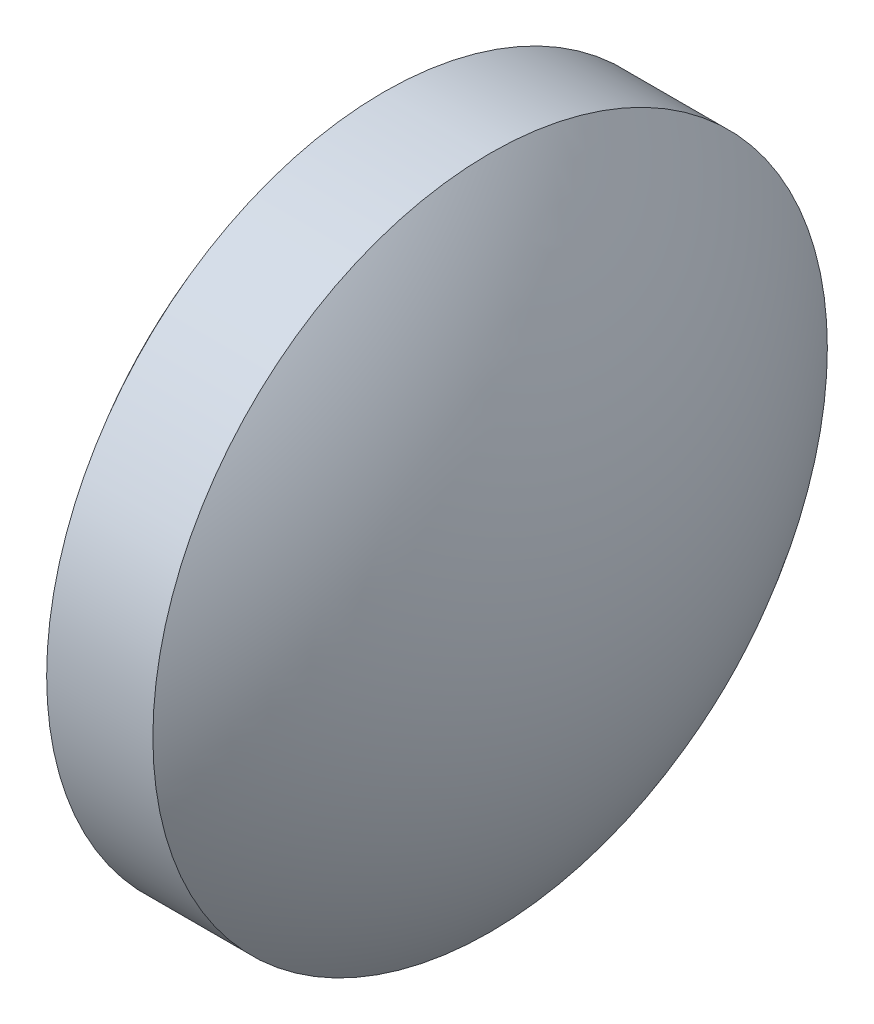
ISO-10303-21;
HEADER;
FILE_DESCRIPTION(('STEP AP214'),'2;1');
FILE_NAME('part.step','',(''),(''),'','','');
FILE_SCHEMA(('AUTOMOTIVE_DESIGN { 1 0 10303 214 1 1 1 1 }'));
ENDSEC;
DATA;
#1=APPLICATION_CONTEXT('core data for automotive mechanical design processes');
#2=APPLICATION_PROTOCOL_DEFINITION('international standard','automotive_design',2000,#1);
#3=PRODUCT_CONTEXT('',#1,'mechanical');
#4=PRODUCT('Part','Part','',(#3));
#5=PRODUCT_RELATED_PRODUCT_CATEGORY('part','',(#4));
#6=PRODUCT_DEFINITION_FORMATION('','',#4);
#7=PRODUCT_DEFINITION_CONTEXT('part definition',#1,'design');
#8=PRODUCT_DEFINITION('design','',#6,#7);
#9=PRODUCT_DEFINITION_SHAPE('','',#8);
#10=(LENGTH_UNIT() NAMED_UNIT(*) SI_UNIT(.MILLI.,.METRE.));
#11=(NAMED_UNIT(*) PLANE_ANGLE_UNIT() SI_UNIT($,.RADIAN.));
#12=(NAMED_UNIT(*) SI_UNIT($,.STERADIAN.) SOLID_ANGLE_UNIT());
#13=UNCERTAINTY_MEASURE_WITH_UNIT(LENGTH_MEASURE(1.E-05),#10,'distance_accuracy_value','');
#14=(GEOMETRIC_REPRESENTATION_CONTEXT(3) GLOBAL_UNCERTAINTY_ASSIGNED_CONTEXT((#13)) GLOBAL_UNIT_ASSIGNED_CONTEXT((#10,
#11,#12)) REPRESENTATION_CONTEXT('',''));
#15=CARTESIAN_POINT('',(0.,0.,0.));
#16=DIRECTION('',(0.,0.,1.));
#17=DIRECTION('',(1.,0.,0.));
#18=AXIS2_PLACEMENT_3D('',#15,#16,#17);
#19=CARTESIAN_POINT('',(50.6313736677514,24.3080565115924,0.));
#20=DIRECTION('',(-1.,0.,0.));
#21=DIRECTION('',(0.,1.,0.));
#22=AXIS2_PLACEMENT_3D('',#19,#20,#21);
#23=SPHERICAL_SURFACE('',#22,10.531919637563);
#24=CARTESIAN_POINT('',(42.229062601617,24.3080565115924,0.));
#25=DIRECTION('',(-1.,0.,0.));
#26=DIRECTION('',(0.,-1.,0.));
#27=AXIS2_PLACEMENT_3D('',#24,#25,#26);
#28=CIRCLE('',#27,6.35);
#29=CARTESIAN_POINT('',(42.229062601617,17.9580565115924,0.));
#30=VERTEX_POINT('',#29);
#31=EDGE_CURVE('E41',#30,#30,#28,.T.);
#32=ORIENTED_EDGE('',*,*,#31,.T.);
#33=EDGE_LOOP('',(#32));
#34=FACE_BOUND('',#33,.T.);
#35=ADVANCED_FACE('F35',(#34),#23,.T.);
#36=CARTESIAN_POINT('',(35.8268201069112,24.3080565115924,0.));
#37=DIRECTION('',(-1.,0.,0.));
#38=DIRECTION('',(0.,1.,0.));
#39=AXIS2_PLACEMENT_3D('',#36,#37,#38);
#40=SPHERICAL_SURFACE('',#39,10.531919637563);
#41=CARTESIAN_POINT('',(44.2291311730455,24.3080565115924,0.));
#42=DIRECTION('',(-1.,0.,0.));
#43=DIRECTION('',(0.,-1.,0.));
#44=AXIS2_PLACEMENT_3D('',#41,#42,#43);
#45=CIRCLE('',#44,6.35);
#46=CARTESIAN_POINT('',(44.2291311730455,17.9580565115924,0.));
#47=VERTEX_POINT('',#46);
#48=EDGE_CURVE('E10',#47,#47,#45,.T.);
#49=ORIENTED_EDGE('',*,*,#48,.F.);
#50=EDGE_LOOP('',(#49));
#51=FACE_BOUND('',#50,.T.);
#52=ADVANCED_FACE('F50',(#51),#40,.T.);
#53=CARTESIAN_POINT('',(35.8268201069112,24.3080565115924,0.));
#54=DIRECTION('',(-1.,0.,0.));
#55=DIRECTION('',(0.,-1.,0.));
#56=AXIS2_PLACEMENT_3D('',#53,#54,#55);
#57=CYLINDRICAL_SURFACE('',#56,6.35);
#58=ORIENTED_EDGE('',*,*,#48,.T.);
#59=EDGE_LOOP('',(#58));
#60=FACE_BOUND('',#59,.T.);
#61=ORIENTED_EDGE('',*,*,#31,.F.);
#62=EDGE_LOOP('',(#61));
#63=FACE_BOUND('',#62,.T.);
#64=ADVANCED_FACE('F48',(#60,#63),#57,.T.);
#65=CLOSED_SHELL('',(#35,#52,#64));
#66=MANIFOLD_SOLID_BREP('B2',#65);
#67=ADVANCED_BREP_SHAPE_REPRESENTATION('',(#18,#66),#14);
#68=SHAPE_DEFINITION_REPRESENTATION(#9,#67);
ENDSEC;
END-ISO-10303-21;
